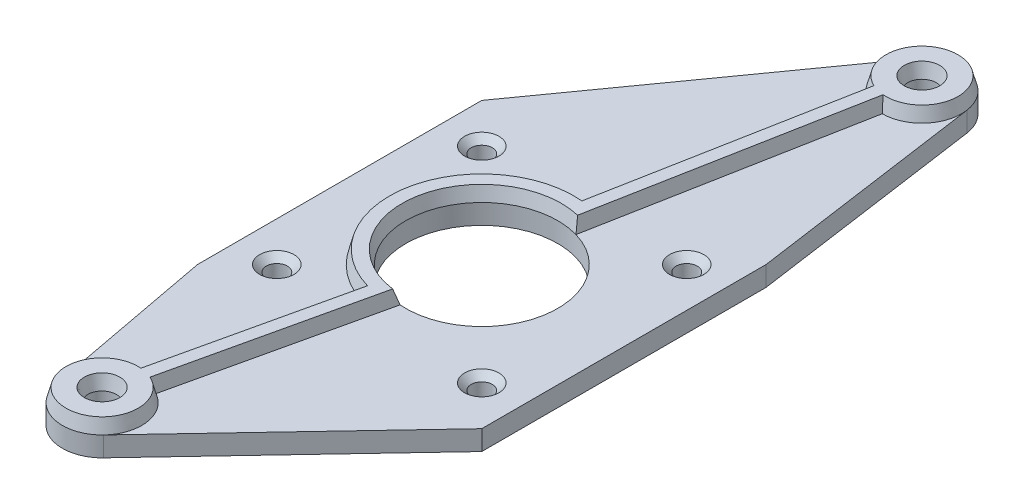
ISO-10303-21;
HEADER;
FILE_DESCRIPTION(('STEP AP214'),'2;1');
FILE_NAME('part.step','',(''),(''),'','','');
FILE_SCHEMA(('AUTOMOTIVE_DESIGN { 1 0 10303 214 1 1 1 1 }'));
ENDSEC;
DATA;
#1=APPLICATION_CONTEXT('core data for automotive mechanical design processes');
#2=APPLICATION_PROTOCOL_DEFINITION('international standard','automotive_design',2000,#1);
#3=PRODUCT_CONTEXT('',#1,'mechanical');
#4=PRODUCT('Part','Part','',(#3));
#5=PRODUCT_RELATED_PRODUCT_CATEGORY('part','',(#4));
#6=PRODUCT_DEFINITION_FORMATION('','',#4);
#7=PRODUCT_DEFINITION_CONTEXT('part definition',#1,'design');
#8=PRODUCT_DEFINITION('design','',#6,#7);
#9=PRODUCT_DEFINITION_SHAPE('','',#8);
#10=(LENGTH_UNIT() NAMED_UNIT(*) SI_UNIT(.MILLI.,.METRE.));
#11=(NAMED_UNIT(*) PLANE_ANGLE_UNIT() SI_UNIT($,.RADIAN.));
#12=(NAMED_UNIT(*) SI_UNIT($,.STERADIAN.) SOLID_ANGLE_UNIT());
#13=UNCERTAINTY_MEASURE_WITH_UNIT(LENGTH_MEASURE(1.E-05),#10,'distance_accuracy_value','');
#14=(GEOMETRIC_REPRESENTATION_CONTEXT(3) GLOBAL_UNCERTAINTY_ASSIGNED_CONTEXT((#13)) GLOBAL_UNIT_ASSIGNED_CONTEXT((#10,
#11,#12)) REPRESENTATION_CONTEXT('',''));
#15=CARTESIAN_POINT('',(0.,0.,0.));
#16=DIRECTION('',(0.,0.,1.));
#17=DIRECTION('',(1.,0.,0.));
#18=AXIS2_PLACEMENT_3D('',#15,#16,#17);
#19=CARTESIAN_POINT('',(-40.2731092172723,3.,45.3108891324553));
#20=DIRECTION('',(0.,-1.,0.));
#21=DIRECTION('',(0.,0.,-1.));
#22=AXIS2_PLACEMENT_3D('',#19,#20,#21);
#23=PLANE('',#22);
#24=CARTESIAN_POINT('',(-19.1038264481304,3.,-57.5329802377707));
#25=DIRECTION('',(0.,1.,0.));
#26=DIRECTION('',(0.,0.,1.));
#27=AXIS2_PLACEMENT_3D('',#24,#25,#26);
#28=CIRCLE('',#27,6.00000000000001);
#29=CARTESIAN_POINT('',(-19.1038264481304,3.,-51.5329802377707));
#30=VERTEX_POINT('',#29);
#31=CARTESIAN_POINT('',(-13.1631885143671,3.,-58.3748952809499));
#32=VERTEX_POINT('',#31);
#33=EDGE_CURVE('E58',#30,#32,#28,.T.);
#34=ORIENTED_EDGE('',*,*,#33,.F.);
#35=DIRECTION('',(0.18482684046529,0.,-0.98277110205969));
#36=VECTOR('',#35,1.);
#37=CARTESIAN_POINT('',(-27.8117995920776,3.,-5.23048249534848));
#38=LINE('',#37,#36);
#39=CARTESIAN_POINT('',(-26.4382641508518,3.,-12.533918164612));
#40=VERTEX_POINT('',#39);
#41=EDGE_CURVE('E348',#40,#30,#38,.T.);
#42=ORIENTED_EDGE('',*,*,#41,.F.);
#43=CARTESIAN_POINT('',(-29.643722033029,3.,-1.48968710194453));
#44=DIRECTION('',(0.,1.,0.));
#45=DIRECTION('',(0.,0.,1.));
#46=AXIS2_PLACEMENT_3D('',#43,#44,#45);
#47=CIRCLE('',#46,11.5);
#48=CARTESIAN_POINT('',(-30.5340940268448,3.,9.97579316329637));
#49=VERTEX_POINT('',#48);
#50=EDGE_CURVE('E481',#49,#40,#47,.T.);
#51=ORIENTED_EDGE('',*,*,#50,.F.);
#52=DIRECTION('',(0.221480280720096,0.,-0.975164850295655));
#53=VECTOR('',#52,1.);
#54=CARTESIAN_POINT('',(-26.8817197346499,3.,-6.10539933967484));
#55=LINE('',#54,#53);
#56=CARTESIAN_POINT('',(-37.3671948603431,3.,40.0615404347412));
#57=VERTEX_POINT('',#56);
#58=EDGE_CURVE('E65',#57,#49,#55,.T.);
#59=ORIENTED_EDGE('',*,*,#58,.F.);
#60=CARTESIAN_POINT('',(-40.2731092172723,3.,45.3108891324553));
#61=DIRECTION('',(0.,1.,0.));
#62=DIRECTION('',(0.,0.,1.));
#63=AXIS2_PLACEMENT_3D('',#60,#61,#62);
#64=CIRCLE('',#63,6.);
#65=CARTESIAN_POINT('',(-35.9096573558158,3.,49.4291761371154));
#66=VERTEX_POINT('',#65);
#67=EDGE_CURVE('E11',#66,#57,#64,.T.);
#68=ORIENTED_EDGE('',*,*,#67,.F.);
#69=DIRECTION('',(0.68638116744335,0.,-0.727241976909408));
#70=VECTOR('',#69,1.);
#71=CARTESIAN_POINT('',(-8.14372203302901,3.,20.0103128980555));
#72=LINE('',#71,#70);
#73=CARTESIAN_POINT('',(-8.14372203302901,3.,20.0103128980555));
#74=VERTEX_POINT('',#73);
#75=EDGE_CURVE('E501',#66,#74,#72,.T.);
#76=ORIENTED_EDGE('',*,*,#75,.T.);
#77=DIRECTION('',(0.,0.,-1.));
#78=VECTOR('',#77,1.);
#79=CARTESIAN_POINT('',(-8.14372203302901,3.,20.0103128980555));
#80=LINE('',#79,#78);
#81=CARTESIAN_POINT('',(-8.14372203302901,3.,-22.9896871019445));
#82=VERTEX_POINT('',#81);
#83=EDGE_CURVE('E504',#74,#82,#80,.T.);
#84=ORIENTED_EDGE('',*,*,#83,.T.);
#85=DIRECTION('',(-0.140446118803796,0.,-0.990088323187861));
#86=VECTOR('',#85,1.);
#87=CARTESIAN_POINT('',(-8.14372203302901,3.,-22.9896871019445));
#88=LINE('',#87,#86);
#89=EDGE_CURVE('E507',#82,#32,#88,.T.);
#90=ORIENTED_EDGE('',*,*,#89,.T.);
#91=EDGE_LOOP('',(#34,#42,#51,#59,#68,#76,#84,#90));
#92=FACE_BOUND('',#91,.T.);
#93=CARTESIAN_POINT('',(-14.143722033029,3.,-16.9896871019445));
#94=DIRECTION('',(0.,-1.,0.));
#95=DIRECTION('',(0.,0.,-1.));
#96=AXIS2_PLACEMENT_3D('',#93,#94,#95);
#97=CIRCLE('',#96,2.6);
#98=CARTESIAN_POINT('',(-14.143722033029,3.,-19.5896871019445));
#99=VERTEX_POINT('',#98);
#100=EDGE_CURVE('E316',#99,#99,#97,.T.);
#101=ORIENTED_EDGE('',*,*,#100,.T.);
#102=EDGE_LOOP('',(#101));
#103=FACE_BOUND('',#102,.T.);
#104=CARTESIAN_POINT('',(-14.143722033029,3.,14.0103128980555));
#105=DIRECTION('',(0.,-1.,0.));
#106=DIRECTION('',(0.,0.,-1.));
#107=AXIS2_PLACEMENT_3D('',#104,#105,#106);
#108=CIRCLE('',#107,2.6);
#109=CARTESIAN_POINT('',(-14.143722033029,3.,11.4103128980555));
#110=VERTEX_POINT('',#109);
#111=EDGE_CURVE('E319',#110,#110,#108,.T.);
#112=ORIENTED_EDGE('',*,*,#111,.T.);
#113=EDGE_LOOP('',(#112));
#114=FACE_BOUND('',#113,.T.);
#115=ADVANCED_FACE('F39',(#92,#103,#114),#23,.F.);
#116=CARTESIAN_POINT('',(-23.9866709572747,3.,-61.019788161864));
#117=VERTEX_POINT('',#116);
#118=CARTESIAN_POINT('',(-22.014726824788,3.,-52.2863947769996));
#119=VERTEX_POINT('',#118);
#120=EDGE_CURVE('E49',#117,#119,#28,.T.);
#121=ORIENTED_EDGE('',*,*,#120,.F.);
#122=DIRECTION('',(-0.581134654015552,0.,0.813807418190707));
#123=VECTOR('',#122,1.);
#124=CARTESIAN_POINT('',(-51.143722033029,3.,-22.9896871019445));
#125=LINE('',#124,#123);
#126=CARTESIAN_POINT('',(-51.143722033029,3.,-22.9896871019445));
#127=VERTEX_POINT('',#126);
#128=EDGE_CURVE('E513',#117,#127,#125,.T.);
#129=ORIENTED_EDGE('',*,*,#128,.T.);
#130=DIRECTION('',(0.,0.,1.));
#131=VECTOR('',#130,1.);
#132=CARTESIAN_POINT('',(-51.143722033029,3.,20.0103128980555));
#133=LINE('',#132,#131);
#134=CARTESIAN_POINT('',(-51.143722033029,3.,20.0103128980555));
#135=VERTEX_POINT('',#134);
#136=EDGE_CURVE('E516',#127,#135,#133,.T.);
#137=ORIENTED_EDGE('',*,*,#136,.T.);
#138=DIRECTION('',(0.185086419509454,0.,0.982722248304764));
#139=VECTOR('',#138,1.);
#140=CARTESIAN_POINT('',(-51.143722033029,3.,20.0103128980555));
#141=LINE('',#140,#139);
#142=CARTESIAN_POINT('',(-46.1694427071008,3.,46.4214076495121));
#143=VERTEX_POINT('',#142);
#144=EDGE_CURVE('E493',#135,#143,#141,.T.);
#145=ORIENTED_EDGE('',*,*,#144,.T.);
#146=CARTESIAN_POINT('',(-40.2731092172723,3.,39.3108891324554));
#147=VERTEX_POINT('',#146);
#148=EDGE_CURVE('E51',#147,#143,#64,.T.);
#149=ORIENTED_EDGE('',*,*,#148,.F.);
#150=DIRECTION('',(-0.221480280720096,0.,0.975164850295655));
#151=VECTOR('',#150,1.);
#152=CARTESIAN_POINT('',(-29.8072142855369,3.,-6.76984018183513));
#153=LINE('',#152,#151);
#154=CARTESIAN_POINT('',(-34.137549548845,3.,12.2963752168648));
#155=VERTEX_POINT('',#154);
#156=EDGE_CURVE('E153',#155,#147,#153,.T.);
#157=ORIENTED_EDGE('',*,*,#156,.F.);
#158=CARTESIAN_POINT('',(-29.643722033029,3.,-1.48968710194453));
#159=DIRECTION('',(0.,1.,0.));
#160=DIRECTION('',(0.,0.,1.));
#161=AXIS2_PLACEMENT_3D('',#158,#159,#160);
#162=CIRCLE('',#161,14.5);
#163=CARTESIAN_POINT('',(-28.8450802723241,3.,-15.9676763041113));
#164=VERTEX_POINT('',#163);
#165=EDGE_CURVE('E157',#164,#155,#162,.T.);
#166=ORIENTED_EDGE('',*,*,#165,.F.);
#167=DIRECTION('',(0.18482684046529,0.,-0.98277110205969));
#168=VECTOR('',#167,1.);
#169=CARTESIAN_POINT('',(-30.7601128982567,3.,-5.78496301674435));
#170=LINE('',#169,#168);
#171=EDGE_CURVE('E176',#164,#119,#170,.T.);
#172=ORIENTED_EDGE('',*,*,#171,.T.);
#173=EDGE_LOOP('',(#121,#129,#137,#145,#149,#157,#166,#172));
#174=FACE_BOUND('',#173,.T.);
#175=CARTESIAN_POINT('',(-45.143722033029,3.,-16.9896871019445));
#176=DIRECTION('',(0.,-1.,0.));
#177=DIRECTION('',(0.,0.,-1.));
#178=AXIS2_PLACEMENT_3D('',#175,#176,#177);
#179=CIRCLE('',#178,2.6);
#180=CARTESIAN_POINT('',(-45.143722033029,3.,-19.5896871019445));
#181=VERTEX_POINT('',#180);
#182=EDGE_CURVE('E328',#181,#181,#179,.T.);
#183=ORIENTED_EDGE('',*,*,#182,.T.);
#184=EDGE_LOOP('',(#183));
#185=FACE_BOUND('',#184,.T.);
#186=CARTESIAN_POINT('',(-45.143722033029,3.,14.0103128980555));
#187=DIRECTION('',(0.,-1.,0.));
#188=DIRECTION('',(0.,0.,-1.));
#189=AXIS2_PLACEMENT_3D('',#186,#187,#188);
#190=CIRCLE('',#189,2.6);
#191=CARTESIAN_POINT('',(-45.143722033029,3.,11.4103128980555));
#192=VERTEX_POINT('',#191);
#193=EDGE_CURVE('E578',#192,#192,#190,.T.);
#194=ORIENTED_EDGE('',*,*,#193,.T.);
#195=EDGE_LOOP('',(#194));
#196=FACE_BOUND('',#195,.T.);
#197=ADVANCED_FACE('F155',(#174,#185,#196),#23,.F.);
#198=CARTESIAN_POINT('',(-40.2731092172723,0.,45.3108891324553));
#199=DIRECTION('',(0.,-1.,0.));
#200=DIRECTION('',(0.,0.,-1.));
#201=AXIS2_PLACEMENT_3D('',#198,#199,#200);
#202=PLANE('',#201);
#203=CARTESIAN_POINT('',(-45.143722033029,0.,-16.9896871019445));
#204=DIRECTION('',(0.,1.,0.));
#205=DIRECTION('',(0.,0.,1.));
#206=AXIS2_PLACEMENT_3D('',#203,#204,#205);
#207=CIRCLE('',#206,1.6);
#208=CARTESIAN_POINT('',(-45.143722033029,0.,-15.3896871019445));
#209=VERTEX_POINT('',#208);
#210=EDGE_CURVE('E465',#209,#209,#207,.T.);
#211=ORIENTED_EDGE('',*,*,#210,.T.);
#212=EDGE_LOOP('',(#211));
#213=FACE_BOUND('',#212,.T.);
#214=CARTESIAN_POINT('',(-14.143722033029,0.,14.0103128980555));
#215=DIRECTION('',(0.,1.,0.));
#216=DIRECTION('',(0.,0.,1.));
#217=AXIS2_PLACEMENT_3D('',#214,#215,#216);
#218=CIRCLE('',#217,1.6);
#219=CARTESIAN_POINT('',(-14.143722033029,0.,15.6103128980555));
#220=VERTEX_POINT('',#219);
#221=EDGE_CURVE('E473',#220,#220,#218,.T.);
#222=ORIENTED_EDGE('',*,*,#221,.T.);
#223=EDGE_LOOP('',(#222));
#224=FACE_BOUND('',#223,.T.);
#225=CARTESIAN_POINT('',(-40.2731092172723,0.,45.3108891324553));
#226=DIRECTION('',(0.,1.,0.));
#227=DIRECTION('',(0.,0.,1.));
#228=AXIS2_PLACEMENT_3D('',#225,#226,#227);
#229=CIRCLE('',#228,2.15);
#230=CARTESIAN_POINT('',(-40.2731092172723,0.,47.4608891324553));
#231=VERTEX_POINT('',#230);
#232=EDGE_CURVE('E480',#231,#231,#229,.T.);
#233=ORIENTED_EDGE('',*,*,#232,.T.);
#234=EDGE_LOOP('',(#233));
#235=FACE_BOUND('',#234,.T.);
#236=DIRECTION('',(0.185086419509454,0.,0.982722248304764));
#237=VECTOR('',#236,1.);
#238=CARTESIAN_POINT('',(-51.143722033029,0.,20.0103128980555));
#239=LINE('',#238,#237);
#240=CARTESIAN_POINT('',(-51.143722033029,0.,20.0103128980555));
#241=VERTEX_POINT('',#240);
#242=CARTESIAN_POINT('',(-46.1694427071008,0.,46.4214076495121));
#243=VERTEX_POINT('',#242);
#244=EDGE_CURVE('E492',#241,#243,#239,.T.);
#245=ORIENTED_EDGE('',*,*,#244,.F.);
#246=DIRECTION('',(0.,0.,1.));
#247=VECTOR('',#246,1.);
#248=CARTESIAN_POINT('',(-51.143722033029,0.,20.0103128980555));
#249=LINE('',#248,#247);
#250=CARTESIAN_POINT('',(-51.143722033029,0.,-22.9896871019445));
#251=VERTEX_POINT('',#250);
#252=EDGE_CURVE('E497',#251,#241,#249,.T.);
#253=ORIENTED_EDGE('',*,*,#252,.F.);
#254=DIRECTION('',(-0.581134654015552,0.,0.813807418190707));
#255=VECTOR('',#254,1.);
#256=CARTESIAN_POINT('',(-51.143722033029,0.,-22.9896871019445));
#257=LINE('',#256,#255);
#258=CARTESIAN_POINT('',(-23.9866709572747,0.,-61.019788161864));
#259=VERTEX_POINT('',#258);
#260=EDGE_CURVE('E538',#259,#251,#257,.T.);
#261=ORIENTED_EDGE('',*,*,#260,.F.);
#262=CARTESIAN_POINT('',(-19.1038264481304,0.,-57.5329802377707));
#263=DIRECTION('',(0.,1.,0.));
#264=DIRECTION('',(0.,0.,-1.));
#265=AXIS2_PLACEMENT_3D('',#262,#263,#264);
#266=CIRCLE('',#265,6.00000000000001);
#267=CARTESIAN_POINT('',(-13.1631885143671,0.,-58.3748952809499));
#268=VERTEX_POINT('',#267);
#269=EDGE_CURVE('E535',#268,#259,#266,.T.);
#270=ORIENTED_EDGE('',*,*,#269,.F.);
#271=DIRECTION('',(-0.140446118803796,0.,-0.990088323187861));
#272=VECTOR('',#271,1.);
#273=CARTESIAN_POINT('',(-8.14372203302901,0.,-22.9896871019445));
#274=LINE('',#273,#272);
#275=CARTESIAN_POINT('',(-8.14372203302901,0.,-22.9896871019445));
#276=VERTEX_POINT('',#275);
#277=EDGE_CURVE('E532',#276,#268,#274,.T.);
#278=ORIENTED_EDGE('',*,*,#277,.F.);
#279=DIRECTION('',(0.,0.,-1.));
#280=VECTOR('',#279,1.);
#281=CARTESIAN_POINT('',(-8.14372203302901,0.,20.0103128980555));
#282=LINE('',#281,#280);
#283=CARTESIAN_POINT('',(-8.14372203302901,0.,20.0103128980555));
#284=VERTEX_POINT('',#283);
#285=EDGE_CURVE('E529',#284,#276,#282,.T.);
#286=ORIENTED_EDGE('',*,*,#285,.F.);
#287=DIRECTION('',(0.68638116744335,0.,-0.727241976909408));
#288=VECTOR('',#287,1.);
#289=CARTESIAN_POINT('',(-8.14372203302901,0.,20.0103128980555));
#290=LINE('',#289,#288);
#291=CARTESIAN_POINT('',(-35.9096573558158,0.,49.4291761371154));
#292=VERTEX_POINT('',#291);
#293=EDGE_CURVE('E526',#292,#284,#290,.T.);
#294=ORIENTED_EDGE('',*,*,#293,.F.);
#295=CARTESIAN_POINT('',(-40.2731092172723,0.,45.3108891324553));
#296=DIRECTION('',(0.,1.,0.));
#297=DIRECTION('',(0.,0.,-1.));
#298=AXIS2_PLACEMENT_3D('',#295,#296,#297);
#299=CIRCLE('',#298,6.);
#300=EDGE_CURVE('E523',#243,#292,#299,.T.);
#301=ORIENTED_EDGE('',*,*,#300,.F.);
#302=EDGE_LOOP('',(#245,#253,#261,#270,#278,#286,#294,#301));
#303=FACE_BOUND('',#302,.T.);
#304=CARTESIAN_POINT('',(-19.1038264481304,0.,-57.5329802377707));
#305=DIRECTION('',(0.,1.,0.));
#306=DIRECTION('',(0.,0.,1.));
#307=AXIS2_PLACEMENT_3D('',#304,#305,#306);
#308=CIRCLE('',#307,2.15);
#309=CARTESIAN_POINT('',(-19.1038264481304,0.,-55.3829802377707));
#310=VERTEX_POINT('',#309);
#311=EDGE_CURVE('E488',#310,#310,#308,.T.);
#312=ORIENTED_EDGE('',*,*,#311,.T.);
#313=EDGE_LOOP('',(#312));
#314=FACE_BOUND('',#313,.T.);
#315=CARTESIAN_POINT('',(-29.643722033029,0.,-1.48968710194453));
#316=DIRECTION('',(0.,1.,0.));
#317=DIRECTION('',(0.,0.,1.));
#318=AXIS2_PLACEMENT_3D('',#315,#316,#317);
#319=CIRCLE('',#318,11.5);
#320=CARTESIAN_POINT('',(-29.643722033029,0.,10.0103128980555));
#321=VERTEX_POINT('',#320);
#322=EDGE_CURVE('E477',#321,#321,#319,.T.);
#323=ORIENTED_EDGE('',*,*,#322,.T.);
#324=EDGE_LOOP('',(#323));
#325=FACE_BOUND('',#324,.T.);
#326=CARTESIAN_POINT('',(-14.143722033029,0.,-16.9896871019445));
#327=DIRECTION('',(0.,1.,0.));
#328=DIRECTION('',(0.,0.,1.));
#329=AXIS2_PLACEMENT_3D('',#326,#327,#328);
#330=CIRCLE('',#329,1.6);
#331=CARTESIAN_POINT('',(-14.143722033029,0.,-15.3896871019445));
#332=VERTEX_POINT('',#331);
#333=EDGE_CURVE('E469',#332,#332,#330,.T.);
#334=ORIENTED_EDGE('',*,*,#333,.T.);
#335=EDGE_LOOP('',(#334));
#336=FACE_BOUND('',#335,.T.);
#337=CARTESIAN_POINT('',(-45.143722033029,0.,14.0103128980555));
#338=DIRECTION('',(0.,1.,0.));
#339=DIRECTION('',(0.,0.,1.));
#340=AXIS2_PLACEMENT_3D('',#337,#338,#339);
#341=CIRCLE('',#340,1.6);
#342=CARTESIAN_POINT('',(-45.143722033029,0.,15.6103128980555));
#343=VERTEX_POINT('',#342);
#344=EDGE_CURVE('E185',#343,#343,#341,.T.);
#345=ORIENTED_EDGE('',*,*,#344,.T.);
#346=EDGE_LOOP('',(#345));
#347=FACE_BOUND('',#346,.T.);
#348=ADVANCED_FACE('F257',(#213,#224,#235,#303,#314,#325,#336,#347),#202,.T.);
#349=CARTESIAN_POINT('',(-51.143722033029,3.,20.0103128980555));
#350=DIRECTION('',(0.982722248304764,0.,-0.185086419509454));
#351=DIRECTION('',(-0.185086419509454,0.,-0.982722248304764));
#352=AXIS2_PLACEMENT_3D('',#349,#350,#351);
#353=PLANE('',#352);
#354=ORIENTED_EDGE('',*,*,#244,.T.);
#355=DIRECTION('',(0.,-1.,0.));
#356=VECTOR('',#355,1.);
#357=CARTESIAN_POINT('',(-46.1694427071008,3.,46.4214076495121));
#358=LINE('',#357,#356);
#359=EDGE_CURVE('E570',#143,#243,#358,.T.);
#360=ORIENTED_EDGE('',*,*,#359,.F.);
#361=ORIENTED_EDGE('',*,*,#144,.F.);
#362=DIRECTION('',(0.,-1.,0.));
#363=VECTOR('',#362,1.);
#364=CARTESIAN_POINT('',(-51.143722033029,3.,20.0103128980555));
#365=LINE('',#364,#363);
#366=EDGE_CURVE('E519',#135,#241,#365,.T.);
#367=ORIENTED_EDGE('',*,*,#366,.T.);
#368=EDGE_LOOP('',(#354,#360,#361,#367));
#369=FACE_BOUND('',#368,.T.);
#370=ADVANCED_FACE('F260',(#369),#353,.F.);
#371=CARTESIAN_POINT('',(-40.2731092172723,3.,45.3108891324553));
#372=DIRECTION('',(0.,-1.,0.));
#373=DIRECTION('',(0.,0.,-1.));
#374=AXIS2_PLACEMENT_3D('',#371,#372,#373);
#375=CYLINDRICAL_SURFACE('',#374,6.);
#376=ORIENTED_EDGE('',*,*,#300,.T.);
#377=DIRECTION('',(0.,-1.,0.));
#378=VECTOR('',#377,1.);
#379=CARTESIAN_POINT('',(-35.9096573558158,3.,49.4291761371154));
#380=LINE('',#379,#378);
#381=EDGE_CURVE('E566',#66,#292,#380,.T.);
#382=ORIENTED_EDGE('',*,*,#381,.F.);
#383=CARTESIAN_POINT('',(-40.2731092172723,3.,45.3108891324553));
#384=DIRECTION('',(0.,1.,0.));
#385=DIRECTION('',(0.,0.,-1.));
#386=AXIS2_PLACEMENT_3D('',#383,#384,#385);
#387=CIRCLE('',#386,6.);
#388=EDGE_CURVE('E496',#143,#66,#387,.T.);
#389=ORIENTED_EDGE('',*,*,#388,.F.);
#390=ORIENTED_EDGE('',*,*,#359,.T.);
#391=EDGE_LOOP('',(#376,#382,#389,#390));
#392=FACE_BOUND('',#391,.T.);
#393=ADVANCED_FACE('F284',(#392),#375,.T.);
#394=CARTESIAN_POINT('',(-8.14372203302901,3.,20.0103128980555));
#395=DIRECTION('',(-0.727241976909408,0.,-0.68638116744335));
#396=DIRECTION('',(-0.68638116744335,0.,0.727241976909408));
#397=AXIS2_PLACEMENT_3D('',#394,#395,#396);
#398=PLANE('',#397);
#399=ORIENTED_EDGE('',*,*,#293,.T.);
#400=DIRECTION('',(0.,-1.,0.));
#401=VECTOR('',#400,1.);
#402=CARTESIAN_POINT('',(-8.14372203302901,3.,20.0103128980555));
#403=LINE('',#402,#401);
#404=EDGE_CURVE('E562',#74,#284,#403,.T.);
#405=ORIENTED_EDGE('',*,*,#404,.F.);
#406=ORIENTED_EDGE('',*,*,#75,.F.);
#407=ORIENTED_EDGE('',*,*,#381,.T.);
#408=EDGE_LOOP('',(#399,#405,#406,#407));
#409=FACE_BOUND('',#408,.T.);
#410=ADVANCED_FACE('F280',(#409),#398,.F.);
#411=CARTESIAN_POINT('',(-8.14372203302901,3.,20.0103128980555));
#412=DIRECTION('',(-1.,0.,0.));
#413=DIRECTION('',(0.,0.,1.));
#414=AXIS2_PLACEMENT_3D('',#411,#412,#413);
#415=PLANE('',#414);
#416=ORIENTED_EDGE('',*,*,#285,.T.);
#417=DIRECTION('',(0.,-1.,0.));
#418=VECTOR('',#417,1.);
#419=CARTESIAN_POINT('',(-8.14372203302901,3.,-22.9896871019445));
#420=LINE('',#419,#418);
#421=EDGE_CURVE('E558',#82,#276,#420,.T.);
#422=ORIENTED_EDGE('',*,*,#421,.F.);
#423=ORIENTED_EDGE('',*,*,#83,.F.);
#424=ORIENTED_EDGE('',*,*,#404,.T.);
#425=EDGE_LOOP('',(#416,#422,#423,#424));
#426=FACE_BOUND('',#425,.T.);
#427=ADVANCED_FACE('F276',(#426),#415,.F.);
#428=CARTESIAN_POINT('',(-8.14372203302901,3.,-22.9896871019445));
#429=DIRECTION('',(-0.990088323187861,0.,0.140446118803796));
#430=DIRECTION('',(0.140446118803796,0.,0.990088323187861));
#431=AXIS2_PLACEMENT_3D('',#428,#429,#430);
#432=PLANE('',#431);
#433=ORIENTED_EDGE('',*,*,#277,.T.);
#434=DIRECTION('',(0.,-1.,0.));
#435=VECTOR('',#434,1.);
#436=CARTESIAN_POINT('',(-13.1631885143671,3.,-58.3748952809499));
#437=LINE('',#436,#435);
#438=EDGE_CURVE('E554',#32,#268,#437,.T.);
#439=ORIENTED_EDGE('',*,*,#438,.F.);
#440=ORIENTED_EDGE('',*,*,#89,.F.);
#441=ORIENTED_EDGE('',*,*,#421,.T.);
#442=EDGE_LOOP('',(#433,#439,#440,#441));
#443=FACE_BOUND('',#442,.T.);
#444=ADVANCED_FACE('F272',(#443),#432,.F.);
#445=CARTESIAN_POINT('',(-19.1038264481304,3.,-57.5329802377707));
#446=DIRECTION('',(0.,-1.,0.));
#447=DIRECTION('',(0.,0.,-1.));
#448=AXIS2_PLACEMENT_3D('',#445,#446,#447);
#449=CYLINDRICAL_SURFACE('',#448,6.00000000000001);
#450=ORIENTED_EDGE('',*,*,#269,.T.);
#451=DIRECTION('',(0.,-1.,0.));
#452=VECTOR('',#451,1.);
#453=CARTESIAN_POINT('',(-23.9866709572747,3.,-61.019788161864));
#454=LINE('',#453,#452);
#455=EDGE_CURVE('E550',#117,#259,#454,.T.);
#456=ORIENTED_EDGE('',*,*,#455,.F.);
#457=CARTESIAN_POINT('',(-19.1038264481304,3.,-57.5329802377707));
#458=DIRECTION('',(0.,1.,0.));
#459=DIRECTION('',(0.,0.,-1.));
#460=AXIS2_PLACEMENT_3D('',#457,#458,#459);
#461=CIRCLE('',#460,6.00000000000001);
#462=EDGE_CURVE('E510',#32,#117,#461,.T.);
#463=ORIENTED_EDGE('',*,*,#462,.F.);
#464=ORIENTED_EDGE('',*,*,#438,.T.);
#465=EDGE_LOOP('',(#450,#456,#463,#464));
#466=FACE_BOUND('',#465,.T.);
#467=ADVANCED_FACE('F268',(#466),#449,.T.);
#468=CARTESIAN_POINT('',(-51.143722033029,3.,-22.9896871019445));
#469=DIRECTION('',(0.813807418190707,0.,0.581134654015552));
#470=DIRECTION('',(0.581134654015552,0.,-0.813807418190707));
#471=AXIS2_PLACEMENT_3D('',#468,#469,#470);
#472=PLANE('',#471);
#473=ORIENTED_EDGE('',*,*,#260,.T.);
#474=DIRECTION('',(0.,-1.,0.));
#475=VECTOR('',#474,1.);
#476=CARTESIAN_POINT('',(-51.143722033029,3.,-22.9896871019445));
#477=LINE('',#476,#475);
#478=EDGE_CURVE('E546',#127,#251,#477,.T.);
#479=ORIENTED_EDGE('',*,*,#478,.F.);
#480=ORIENTED_EDGE('',*,*,#128,.F.);
#481=ORIENTED_EDGE('',*,*,#455,.T.);
#482=EDGE_LOOP('',(#473,#479,#480,#481));
#483=FACE_BOUND('',#482,.T.);
#484=ADVANCED_FACE('F264',(#483),#472,.F.);
#485=CARTESIAN_POINT('',(-51.143722033029,3.,20.0103128980555));
#486=DIRECTION('',(1.,0.,0.));
#487=DIRECTION('',(0.,0.,-1.));
#488=AXIS2_PLACEMENT_3D('',#485,#486,#487);
#489=PLANE('',#488);
#490=ORIENTED_EDGE('',*,*,#252,.T.);
#491=ORIENTED_EDGE('',*,*,#366,.F.);
#492=ORIENTED_EDGE('',*,*,#136,.F.);
#493=ORIENTED_EDGE('',*,*,#478,.T.);
#494=EDGE_LOOP('',(#490,#491,#492,#493));
#495=FACE_BOUND('',#494,.T.);
#496=ADVANCED_FACE('F253',(#495),#489,.F.);
#497=CARTESIAN_POINT('',(-19.1038264481304,3.,-57.5329802377707));
#498=DIRECTION('',(0.,-1.,0.));
#499=DIRECTION('',(0.,0.,-1.));
#500=AXIS2_PLACEMENT_3D('',#497,#498,#499);
#501=CYLINDRICAL_SURFACE('',#500,2.15);
#502=CARTESIAN_POINT('',(-19.1038264481304,3.,-57.5329802377707));
#503=DIRECTION('',(0.,1.,0.));
#504=DIRECTION('',(0.,0.,1.));
#505=AXIS2_PLACEMENT_3D('',#502,#503,#504);
#506=CIRCLE('',#505,2.15);
#507=CARTESIAN_POINT('',(-19.1038264481304,3.,-55.3829802377707));
#508=VERTEX_POINT('',#507);
#509=EDGE_CURVE('E347',#508,#508,#506,.F.);
#510=ORIENTED_EDGE('',*,*,#509,.F.);
#511=EDGE_LOOP('',(#510));
#512=FACE_BOUND('',#511,.T.);
#513=ORIENTED_EDGE('',*,*,#311,.F.);
#514=EDGE_LOOP('',(#513));
#515=FACE_BOUND('',#514,.T.);
#516=ADVANCED_FACE('F249',(#512,#515),#501,.F.);
#517=CARTESIAN_POINT('',(-40.2731092172723,3.,45.3108891324553));
#518=DIRECTION('',(0.,-1.,0.));
#519=DIRECTION('',(0.,0.,-1.));
#520=AXIS2_PLACEMENT_3D('',#517,#518,#519);
#521=CYLINDRICAL_SURFACE('',#520,2.15);
#522=CARTESIAN_POINT('',(-40.2731092172723,3.,45.3108891324553));
#523=DIRECTION('',(0.,1.,0.));
#524=DIRECTION('',(0.,0.,1.));
#525=AXIS2_PLACEMENT_3D('',#522,#523,#524);
#526=CIRCLE('',#525,2.15);
#527=CARTESIAN_POINT('',(-40.2731092172723,3.,47.4608891324553));
#528=VERTEX_POINT('',#527);
#529=EDGE_CURVE('E353',#528,#528,#526,.F.);
#530=ORIENTED_EDGE('',*,*,#529,.F.);
#531=EDGE_LOOP('',(#530));
#532=FACE_BOUND('',#531,.T.);
#533=ORIENTED_EDGE('',*,*,#232,.F.);
#534=EDGE_LOOP('',(#533));
#535=FACE_BOUND('',#534,.T.);
#536=ADVANCED_FACE('F245',(#532,#535),#521,.F.);
#537=CARTESIAN_POINT('',(-29.643722033029,3.,-1.48968710194453));
#538=DIRECTION('',(0.,-1.,0.));
#539=DIRECTION('',(0.,0.,-1.));
#540=AXIS2_PLACEMENT_3D('',#537,#538,#539);
#541=CYLINDRICAL_SURFACE('',#540,11.5);
#542=EDGE_CURVE('E441',#40,#49,#47,.T.);
#543=ORIENTED_EDGE('',*,*,#542,.T.);
#544=ORIENTED_EDGE('',*,*,#50,.T.);
#545=EDGE_LOOP('',(#543,#544));
#546=FACE_BOUND('',#545,.T.);
#547=ORIENTED_EDGE('',*,*,#322,.F.);
#548=EDGE_LOOP('',(#547));
#549=FACE_BOUND('',#548,.T.);
#550=ADVANCED_FACE('F241',(#546,#549),#541,.F.);
#551=CARTESIAN_POINT('',(-14.143722033029,3.,14.0103128980555));
#552=DIRECTION('',(0.,-1.,0.));
#553=DIRECTION('',(0.,0.,-1.));
#554=AXIS2_PLACEMENT_3D('',#551,#552,#553);
#555=CYLINDRICAL_SURFACE('',#554,1.6);
#556=CARTESIAN_POINT('',(-14.143722033029,2.00000000000001,14.0103128980555));
#557=DIRECTION('',(0.,-1.,0.));
#558=DIRECTION('',(0.,0.,-1.));
#559=AXIS2_PLACEMENT_3D('',#556,#557,#558);
#560=CIRCLE('',#559,1.6);
#561=CARTESIAN_POINT('',(-14.143722033029,2.00000000000001,12.4103128980555));
#562=VERTEX_POINT('',#561);
#563=EDGE_CURVE('E574',#562,#562,#560,.F.);
#564=ORIENTED_EDGE('',*,*,#563,.T.);
#565=EDGE_LOOP('',(#564));
#566=FACE_BOUND('',#565,.T.);
#567=ORIENTED_EDGE('',*,*,#221,.F.);
#568=EDGE_LOOP('',(#567));
#569=FACE_BOUND('',#568,.T.);
#570=ADVANCED_FACE('F237',(#566,#569),#555,.F.);
#571=CARTESIAN_POINT('',(-14.143722033029,3.,-16.9896871019445));
#572=DIRECTION('',(0.,-1.,0.));
#573=DIRECTION('',(0.,0.,-1.));
#574=AXIS2_PLACEMENT_3D('',#571,#572,#573);
#575=CYLINDRICAL_SURFACE('',#574,1.6);
#576=CARTESIAN_POINT('',(-14.143722033029,2.00000000000001,-16.9896871019445));
#577=DIRECTION('',(0.,-1.,0.));
#578=DIRECTION('',(0.,0.,-1.));
#579=AXIS2_PLACEMENT_3D('',#576,#577,#578);
#580=CIRCLE('',#579,1.6);
#581=CARTESIAN_POINT('',(-14.143722033029,2.00000000000001,-18.5896871019445));
#582=VERTEX_POINT('',#581);
#583=EDGE_CURVE('E321',#582,#582,#580,.F.);
#584=ORIENTED_EDGE('',*,*,#583,.T.);
#585=EDGE_LOOP('',(#584));
#586=FACE_BOUND('',#585,.T.);
#587=ORIENTED_EDGE('',*,*,#333,.F.);
#588=EDGE_LOOP('',(#587));
#589=FACE_BOUND('',#588,.T.);
#590=ADVANCED_FACE('F233',(#586,#589),#575,.F.);
#591=CARTESIAN_POINT('',(-45.143722033029,3.,-16.9896871019445));
#592=DIRECTION('',(0.,-1.,0.));
#593=DIRECTION('',(0.,0.,-1.));
#594=AXIS2_PLACEMENT_3D('',#591,#592,#593);
#595=CYLINDRICAL_SURFACE('',#594,1.6);
#596=CARTESIAN_POINT('',(-45.143722033029,2.,-16.9896871019445));
#597=DIRECTION('',(0.,-1.,0.));
#598=DIRECTION('',(0.,0.,-1.));
#599=AXIS2_PLACEMENT_3D('',#596,#597,#598);
#600=CIRCLE('',#599,1.6);
#601=CARTESIAN_POINT('',(-45.143722033029,2.,-18.5896871019445));
#602=VERTEX_POINT('',#601);
#603=EDGE_CURVE('E326',#602,#602,#600,.F.);
#604=ORIENTED_EDGE('',*,*,#603,.T.);
#605=EDGE_LOOP('',(#604));
#606=FACE_BOUND('',#605,.T.);
#607=ORIENTED_EDGE('',*,*,#210,.F.);
#608=EDGE_LOOP('',(#607));
#609=FACE_BOUND('',#608,.T.);
#610=ADVANCED_FACE('F229',(#606,#609),#595,.F.);
#611=CARTESIAN_POINT('',(-45.143722033029,3.,14.0103128980555));
#612=DIRECTION('',(0.,-1.,0.));
#613=DIRECTION('',(0.,0.,-1.));
#614=AXIS2_PLACEMENT_3D('',#611,#612,#613);
#615=CYLINDRICAL_SURFACE('',#614,1.6);
#616=CARTESIAN_POINT('',(-45.143722033029,2.,14.0103128980555));
#617=DIRECTION('',(0.,-1.,0.));
#618=DIRECTION('',(0.,0.,-1.));
#619=AXIS2_PLACEMENT_3D('',#616,#617,#618);
#620=CIRCLE('',#619,1.6);
#621=CARTESIAN_POINT('',(-45.143722033029,2.,12.4103128980555));
#622=VERTEX_POINT('',#621);
#623=EDGE_CURVE('E43',#622,#622,#620,.F.);
#624=ORIENTED_EDGE('',*,*,#623,.T.);
#625=EDGE_LOOP('',(#624));
#626=FACE_BOUND('',#625,.T.);
#627=ORIENTED_EDGE('',*,*,#344,.F.);
#628=EDGE_LOOP('',(#627));
#629=FACE_BOUND('',#628,.T.);
#630=ADVANCED_FACE('F225',(#626,#629),#615,.F.);
#631=CARTESIAN_POINT('',(-14.143722033029,2.00000000000001,14.0103128980555));
#632=DIRECTION('',(0.,1.,0.));
#633=DIRECTION('',(0.,0.,1.));
#634=AXIS2_PLACEMENT_3D('',#631,#632,#633);
#635=CONICAL_SURFACE('',#634,1.6,0.785398163397452);
#636=ORIENTED_EDGE('',*,*,#111,.F.);
#637=EDGE_LOOP('',(#636));
#638=FACE_BOUND('',#637,.T.);
#639=ORIENTED_EDGE('',*,*,#563,.F.);
#640=EDGE_LOOP('',(#639));
#641=FACE_BOUND('',#640,.T.);
#642=ADVANCED_FACE('F228',(#638,#641),#635,.F.);
#643=CARTESIAN_POINT('',(-14.143722033029,2.00000000000001,-16.9896871019445));
#644=DIRECTION('',(0.,1.,0.));
#645=DIRECTION('',(0.,0.,1.));
#646=AXIS2_PLACEMENT_3D('',#643,#644,#645);
#647=CONICAL_SURFACE('',#646,1.6,0.785398163397452);
#648=ORIENTED_EDGE('',*,*,#100,.F.);
#649=EDGE_LOOP('',(#648));
#650=FACE_BOUND('',#649,.T.);
#651=ORIENTED_EDGE('',*,*,#583,.F.);
#652=EDGE_LOOP('',(#651));
#653=FACE_BOUND('',#652,.T.);
#654=ADVANCED_FACE('F294',(#650,#653),#647,.F.);
#655=CARTESIAN_POINT('',(-45.143722033029,2.,-16.9896871019445));
#656=DIRECTION('',(0.,1.,0.));
#657=DIRECTION('',(0.,0.,1.));
#658=AXIS2_PLACEMENT_3D('',#655,#656,#657);
#659=CONICAL_SURFACE('',#658,1.6,0.785398163397452);
#660=ORIENTED_EDGE('',*,*,#182,.F.);
#661=EDGE_LOOP('',(#660));
#662=FACE_BOUND('',#661,.T.);
#663=ORIENTED_EDGE('',*,*,#603,.F.);
#664=EDGE_LOOP('',(#663));
#665=FACE_BOUND('',#664,.T.);
#666=ADVANCED_FACE('F297',(#662,#665),#659,.F.);
#667=CARTESIAN_POINT('',(-45.143722033029,2.,14.0103128980555));
#668=DIRECTION('',(0.,1.,0.));
#669=DIRECTION('',(0.,0.,1.));
#670=AXIS2_PLACEMENT_3D('',#667,#668,#669);
#671=CONICAL_SURFACE('',#670,1.6,0.785398163397452);
#672=ORIENTED_EDGE('',*,*,#193,.F.);
#673=EDGE_LOOP('',(#672));
#674=FACE_BOUND('',#673,.T.);
#675=ORIENTED_EDGE('',*,*,#623,.F.);
#676=EDGE_LOOP('',(#675));
#677=FACE_BOUND('',#676,.T.);
#678=ADVANCED_FACE('F41',(#674,#677),#671,.F.);
#679=CARTESIAN_POINT('',(-30.7601128982567,3.,-5.78496301674435));
#680=DIRECTION('',(-0.949283988810025,0.258819045102521,-0.178529018596833));
#681=DIRECTION('',(-0.263044955168612,-0.964783577575999,0.));
#682=AXIS2_PLACEMENT_3D('',#679,#680,#681);
#683=PLANE('',#682);
#684=ORIENTED_EDGE('',*,*,#171,.F.);
#685=CARTESIAN_POINT('',(-28.4067561971403,5.,-15.3988944639309));
#686=CARTESIAN_POINT('',(-28.4794988592924,4.66695170498595,-15.4949337372042));
#687=CARTESIAN_POINT('',(-28.5523971990036,4.33376088003534,-15.5903518635446));
#688=CARTESIAN_POINT('',(-28.6985052241051,3.66709421333184,-15.7799458101108));
#689=CARTESIAN_POINT('',(-28.7717149094551,3.33361837161578,-15.8741216304972));
#690=CARTESIAN_POINT('',(-28.8450802723241,3.,-15.9676763041113));
#691=B_SPLINE_CURVE_WITH_KNOTS('',3,(#685,#686,#687,#688,#689,#690),.UNSPECIFIED.,.F.,.F.,(4,2,
4),(0.,1.06250374746829,2.12500735764783),.UNSPECIFIED.);
#692=CARTESIAN_POINT('',(-28.4067561971403,5.,-15.3988944639309));
#693=VERTEX_POINT('',#692);
#694=EDGE_CURVE('E173',#693,#164,#691,.T.);
#695=ORIENTED_EDGE('',*,*,#694,.F.);
#696=DIRECTION('',(0.18482684046529,0.,-0.98277110205969));
#697=VECTOR('',#696,1.);
#698=CARTESIAN_POINT('',(-30.2334474519736,5.,-5.6859146114598));
#699=LINE('',#698,#697);
#700=CARTESIAN_POINT('',(-21.4139803889184,5.,-52.5812537479075));
#701=VERTEX_POINT('',#700);
#702=EDGE_CURVE('E202',#693,#701,#699,.T.);
#703=ORIENTED_EDGE('',*,*,#702,.T.);
#704=CARTESIAN_POINT('',(-21.4139803889184,5.,-52.5812537479075));
#705=CARTESIAN_POINT('',(-21.4642070506227,4.83356252951338,-52.5554754255774));
#706=CARTESIAN_POINT('',(-21.5143901643654,4.66706203957337,-52.5300200200366));
#707=CARTESIAN_POINT('',(-21.6146725378132,4.33394527604685,-52.4797229372384));
#708=CARTESIAN_POINT('',(-21.6647717984826,4.1673290038235,-52.4548812528772));
#709=CARTESIAN_POINT('',(-21.7648908013236,3.83398730703861,-52.4057789456622));
#710=CARTESIAN_POINT('',(-21.8149105436055,3.66726188262885,-52.3815183220022));
#711=CARTESIAN_POINT('',(-21.9148745704151,3.33370683271675,-52.3335493662143));
#712=CARTESIAN_POINT('',(-21.9648188540623,3.16687720603017,-52.3098410404847));
#713=CARTESIAN_POINT('',(-22.014726824788,3.00000000000001,-52.2863947769995));
#714=B_SPLINE_CURVE_WITH_KNOTS('',3,(#704,#705,#706,#707,#708,#709,#710,#711,#712,#713),
.UNSPECIFIED.,.F.,.F.,(4,2,2,2,4),(0.,0.527254693904208,1.0545032819403,1.58175113831476,
2.10900509982534),.UNSPECIFIED.);
#715=EDGE_CURVE('E365',#701,#119,#714,.T.);
#716=ORIENTED_EDGE('',*,*,#715,.T.);
#717=EDGE_LOOP('',(#684,#695,#703,#716));
#718=FACE_BOUND('',#717,.T.);
#719=ADVANCED_FACE('F304',(#718),#683,.T.);
#720=CARTESIAN_POINT('',(-29.643722033029,3.,-1.48968710194453));
#721=DIRECTION('',(0.,-1.,0.));
#722=DIRECTION('',(0.,0.,1.));
#723=AXIS2_PLACEMENT_3D('',#720,#721,#722);
#724=CONICAL_SURFACE('',#723,14.5,0.26179938779915);
#725=ORIENTED_EDGE('',*,*,#165,.T.);
#726=CARTESIAN_POINT('',(-33.5047938130908,5.,11.9300095647877));
#727=CARTESIAN_POINT('',(-33.6104740512351,4.66698537843754,11.9924289126812));
#728=CARTESIAN_POINT('',(-33.716043818878,4.33381138854725,12.0541690598608));
#729=CARTESIAN_POINT('',(-33.9269623974298,3.66714472183304,12.1762909436839));
#730=CARTESIAN_POINT('',(-34.0323112083717,3.33365204505667,12.23667268053));
#731=CARTESIAN_POINT('',(-34.137549548845,3.,12.2963752168648));
#732=B_SPLINE_CURVE_WITH_KNOTS('',3,(#726,#727,#728,#729,#730,#731),.UNSPECIFIED.,.F.,.F.,(4,2,
4),(0.,1.06473262483127,2.12946509084048),.UNSPECIFIED.);
#733=CARTESIAN_POINT('',(-33.5047938130908,5.,11.9300095647877));
#734=VERTEX_POINT('',#733);
#735=EDGE_CURVE('E171',#734,#155,#732,.T.);
#736=ORIENTED_EDGE('',*,*,#735,.F.);
#737=CARTESIAN_POINT('',(-29.643722033029,5.,-1.48968710194453));
#738=DIRECTION('',(0.,1.,0.));
#739=DIRECTION('',(0.,0.,1.));
#740=AXIS2_PLACEMENT_3D('',#737,#738,#739);
#741=CIRCLE('',#740,13.9641016151378);
#742=EDGE_CURVE('E632',#693,#734,#741,.T.);
#743=ORIENTED_EDGE('',*,*,#742,.F.);
#744=ORIENTED_EDGE('',*,*,#694,.T.);
#745=EDGE_LOOP('',(#725,#736,#743,#744));
#746=FACE_BOUND('',#745,.T.);
#747=ADVANCED_FACE('F169',(#746),#724,.T.);
#748=CARTESIAN_POINT('',(-29.8072142855369,3.,-6.76984018183513));
#749=DIRECTION('',(-0.941936913789886,0.258819045102521,-0.213933523161294));
#750=DIRECTION('',(-0.264953182521529,-0.964261277388921,0.));
#751=AXIS2_PLACEMENT_3D('',#748,#749,#750);
#752=PLANE('',#751);
#753=ORIENTED_EDGE('',*,*,#156,.T.);
#754=CARTESIAN_POINT('',(-39.8490199707243,5.,39.863269948673));
#755=CARTESIAN_POINT('',(-39.8839594303526,4.83363738238833,39.8158391070301));
#756=CARTESIAN_POINT('',(-39.9190073891252,4.66719059645845,39.7687841531118));
#757=CARTESIAN_POINT('',(-39.9893073839299,4.33414331413818,39.6753868250865));
#758=CARTESIAN_POINT('',(-40.0245594165963,4.16754282032082,39.6290444392727));
#759=CARTESIAN_POINT('',(-40.0952557174432,3.83419760925188,39.5370315864419));
#760=CARTESIAN_POINT('',(-40.1306999852387,3.66745289228982,39.4913611180794));
#761=CARTESIAN_POINT('',(-40.20177074315,3.33382619848248,39.4006564372166));
#762=CARTESIAN_POINT('',(-40.2373972362529,3.16694421942513,39.3556222351916));
#763=CARTESIAN_POINT('',(-40.2731092172723,3.00000000000001,39.3108891324553));
#764=B_SPLINE_CURVE_WITH_KNOTS('',3,(#754,#755,#756,#757,#758,#759,#760,#761,#762,#763),
.UNSPECIFIED.,.F.,.F.,(4,2,2,2,4),(0.,0.529454392871735,1.05890007803597,1.58834470279997,
2.11779803402395),.UNSPECIFIED.);
#765=CARTESIAN_POINT('',(-39.8490199707243,5.,39.863269948673));
#766=VERTEX_POINT('',#765);
#767=EDGE_CURVE('E181',#766,#147,#764,.T.);
#768=ORIENTED_EDGE('',*,*,#767,.F.);
#769=DIRECTION('',(0.221480280720096,0.,-0.975164850295655));
#770=VECTOR('',#769,1.);
#771=CARTESIAN_POINT('',(-29.284625017289,5.,-6.65114925711839));
#772=LINE('',#771,#770);
#773=EDGE_CURVE('E179',#734,#766,#772,.F.);
#774=ORIENTED_EDGE('',*,*,#773,.F.);
#775=ORIENTED_EDGE('',*,*,#735,.T.);
#776=EDGE_LOOP('',(#753,#768,#774,#775));
#777=FACE_BOUND('',#776,.T.);
#778=ADVANCED_FACE('F178',(#777),#752,.T.);
#779=CARTESIAN_POINT('',(-40.2731092172723,3.,45.3108891324553));
#780=DIRECTION('',(0.,-1.,0.));
#781=DIRECTION('',(0.,0.,1.));
#782=AXIS2_PLACEMENT_3D('',#779,#780,#781);
#783=CONICAL_SURFACE('',#782,6.,0.26179938779915);
#784=ORIENTED_EDGE('',*,*,#148,.T.);
#785=ORIENTED_EDGE('',*,*,#388,.T.);
#786=ORIENTED_EDGE('',*,*,#67,.T.);
#787=CARTESIAN_POINT('',(-37.9822983646408,5.,40.3501843339396));
#788=CARTESIAN_POINT('',(-37.9308178576484,4.83358946633753,40.3248438712612));
#789=CARTESIAN_POINT('',(-37.8793962996687,4.66710832784035,40.2998483761503));
#790=CARTESIAN_POINT('',(-37.7766663271022,4.33401662372657,40.2505121320372));
#791=CARTESIAN_POINT('',(-37.7253579110215,4.16740605985867,40.2261713743417));
#792=CARTESIAN_POINT('',(-37.6228481822561,3.8340631327621,40.1781087831592));
#793=CARTESIAN_POINT('',(-37.5716468693999,3.66733076972891,40.154386948681));
#794=CARTESIAN_POINT('',(-37.4693457610552,3.33374990327393,40.1075307626889));
#795=CARTESIAN_POINT('',(-37.418245966924,3.16690139833891,40.0843964189825));
#796=CARTESIAN_POINT('',(-37.3671948603431,3.00000000000001,40.0615404347412));
#797=B_SPLINE_CURVE_WITH_KNOTS('',3,(#787,#788,#789,#790,#791,#792,#793,#794,#795,#796),
.UNSPECIFIED.,.F.,.F.,(4,2,2,2,4),(0.,0.52807481524786,1.05614261552343,1.58420957008467,
2.11228353871802),.UNSPECIFIED.);
#798=CARTESIAN_POINT('',(-37.9822983646408,5.,40.3501843339396));
#799=VERTEX_POINT('',#798);
#800=EDGE_CURVE('E187',#799,#57,#797,.T.);
#801=ORIENTED_EDGE('',*,*,#800,.F.);
#802=CARTESIAN_POINT('',(-40.2731092172723,5.,45.3108891324553));
#803=DIRECTION('',(0.,1.,0.));
#804=DIRECTION('',(0.,0.,1.));
#805=AXIS2_PLACEMENT_3D('',#802,#803,#804);
#806=CIRCLE('',#805,5.46410161513775);
#807=EDGE_CURVE('E453',#766,#799,#806,.T.);
#808=ORIENTED_EDGE('',*,*,#807,.F.);
#809=ORIENTED_EDGE('',*,*,#767,.T.);
#810=EDGE_LOOP('',(#784,#785,#786,#801,#808,#809));
#811=FACE_BOUND('',#810,.T.);
#812=ADVANCED_FACE('F210',(#811),#783,.T.);
#813=CARTESIAN_POINT('',(-26.8817197346499,3.,-6.10539933967484));
#814=DIRECTION('',(0.941936913789886,0.258819045102521,0.213933523161294));
#815=DIRECTION('',(-0.264953182521529,0.964261277388921,0.));
#816=AXIS2_PLACEMENT_3D('',#813,#814,#815);
#817=PLANE('',#816);
#818=ORIENTED_EDGE('',*,*,#58,.T.);
#819=CARTESIAN_POINT('',(-31.1905258021476,5.,10.4464030464487));
#820=CARTESIAN_POINT('',(-31.1359969720076,4.83300443631659,10.4083487690007));
#821=CARTESIAN_POINT('',(-31.0814262403305,4.6660856963047,10.3700170594194));
#822=CARTESIAN_POINT('',(-30.9721992100804,4.33241152329832,10.292779323607));
#823=CARTESIAN_POINT('',(-30.9175429125507,4.16565608835219,10.2538733043311));
#824=CARTESIAN_POINT('',(-30.8081416252749,3.83231401546138,10.1754665466838));
#825=CARTESIAN_POINT('',(-30.7533966354608,3.66572737764633,10.1359658078562));
#826=CARTESIAN_POINT('',(-30.6438147472809,3.33272950572019,10.0563474569094));
#827=CARTESIAN_POINT('',(-30.5889778478109,3.16631827375604,10.0162298373311));
#828=CARTESIAN_POINT('',(-30.5340940268448,3.,9.97579316329637));
#829=B_SPLINE_CURVE_WITH_KNOTS('',3,(#819,#820,#821,#822,#823,#824,#825,#826,#827,#828),
.UNSPECIFIED.,.F.,.F.,(4,2,2,2,4),(0.,0.539241333598409,1.07847614215813,1.61771136449158,
2.15695311207219),.UNSPECIFIED.);
#830=CARTESIAN_POINT('',(-31.1905258021476,5.,10.4464030464487));
#831=VERTEX_POINT('',#830);
#832=EDGE_CURVE('E411',#831,#49,#829,.T.);
#833=ORIENTED_EDGE('',*,*,#832,.F.);
#834=DIRECTION('',(-0.221480280720096,0.,0.975164850295655));
#835=VECTOR('',#834,1.);
#836=CARTESIAN_POINT('',(-27.4043090028978,5.,-6.22409026439157));
#837=LINE('',#836,#835);
#838=EDGE_CURVE('E447',#799,#831,#837,.F.);
#839=ORIENTED_EDGE('',*,*,#838,.F.);
#840=ORIENTED_EDGE('',*,*,#800,.T.);
#841=EDGE_LOOP('',(#818,#833,#839,#840));
#842=FACE_BOUND('',#841,.T.);
#843=ADVANCED_FACE('F422',(#842),#817,.T.);
#844=CARTESIAN_POINT('',(-29.643722033029,3.,-1.48968710194453));
#845=DIRECTION('',(0.,1.,0.));
#846=DIRECTION('',(0.,0.,1.));
#847=AXIS2_PLACEMENT_3D('',#844,#845,#846);
#848=CONICAL_SURFACE('',#847,11.5,0.26179938779915);
#849=ORIENTED_EDGE('',*,*,#542,.F.);
#850=CARTESIAN_POINT('',(-26.8584984835101,5.,-13.1988877454528));
#851=CARTESIAN_POINT('',(-26.8232061871512,4.83304765570639,-13.1445098379165));
#852=CARTESIAN_POINT('',(-26.7879787409852,4.66616224692321,-13.0898841439681));
#853=CARTESIAN_POINT('',(-26.7176587967753,4.33253332143494,-12.9801209080809));
#854=CARTESIAN_POINT('',(-26.6825662973815,4.16578980332361,-12.9249833712808));
#855=CARTESIAN_POINT('',(-26.6125207643754,3.83244922661543,-12.8141790497051));
#856=CARTESIAN_POINT('',(-26.5775677308507,3.66585216811061,-12.758512264597));
#857=CARTESIAN_POINT('',(-26.5078061497535,3.3328099694218,-12.6466306666873));
#858=CARTESIAN_POINT('',(-26.4729976036337,3.16636483077818,-12.590415848395));
#859=CARTESIAN_POINT('',(-26.4382641508518,3.,-12.533918164612));
#860=B_SPLINE_CURVE_WITH_KNOTS('',3,(#850,#851,#852,#853,#854,#855,#856,#857,#858,#859),
.UNSPECIFIED.,.F.,.F.,(4,2,2,2,4),(0.,0.537289655107617,1.07457392178407,1.61185852586283,
2.14914851852592),.UNSPECIFIED.);
#861=CARTESIAN_POINT('',(-26.8584984835101,5.,-13.1988877454528));
#862=VERTEX_POINT('',#861);
#863=EDGE_CURVE('E374',#862,#40,#860,.T.);
#864=ORIENTED_EDGE('',*,*,#863,.F.);
#865=CARTESIAN_POINT('',(-29.643722033029,5.,-1.48968710194453));
#866=DIRECTION('',(0.,1.,0.));
#867=DIRECTION('',(0.,0.,1.));
#868=AXIS2_PLACEMENT_3D('',#865,#866,#867);
#869=CIRCLE('',#868,12.0358983848622);
#870=EDGE_CURVE('E442',#831,#862,#869,.F.);
#871=ORIENTED_EDGE('',*,*,#870,.F.);
#872=ORIENTED_EDGE('',*,*,#832,.T.);
#873=EDGE_LOOP('',(#849,#864,#871,#872));
#874=FACE_BOUND('',#873,.T.);
#875=ADVANCED_FACE('F402',(#874),#848,.F.);
#876=CARTESIAN_POINT('',(-27.8117995920776,3.,-5.23048249534848));
#877=DIRECTION('',(0.949283988810024,0.258819045102521,0.178529018596833));
#878=DIRECTION('',(-0.263044955168612,0.964783577575999,0.));
#879=AXIS2_PLACEMENT_3D('',#876,#877,#878);
#880=PLANE('',#879);
#881=ORIENTED_EDGE('',*,*,#41,.T.);
#882=CARTESIAN_POINT('',(-19.5449801210957,5.,-52.0867163901977));
#883=CARTESIAN_POINT('',(-19.5085947491895,4.8336726738851,-52.0390567502752));
#884=CARTESIAN_POINT('',(-19.4721069892592,4.66725113564569,-51.991804951164));
#885=CARTESIAN_POINT('',(-19.3989394933076,4.33423645271861,-51.8980733552383));
#886=CARTESIAN_POINT('',(-19.3622597609231,4.16764331132958,-51.8515935438679));
#887=CARTESIAN_POINT('',(-19.2887198305515,3.83429634527453,-51.7593605549029));
#888=CARTESIAN_POINT('',(-19.2518596329822,3.66754252098133,-51.7136073756266));
#889=CARTESIAN_POINT('',(-19.1779683984728,3.33388214775219,-51.6227880036167));
#890=CARTESIAN_POINT('',(-19.1409373583213,3.1669755959931,-51.5777218238657));
#891=CARTESIAN_POINT('',(-19.1038264481304,3.00000000000001,-51.5329802377707));
#892=B_SPLINE_CURVE_WITH_KNOTS('',3,(#882,#883,#884,#885,#886,#887,#888,#889,#890,#891),
.UNSPECIFIED.,.F.,.F.,(4,2,2,2,4),(0.,0.530415047637335,1.06082008283109,1.59122389029889,
2.12163770866614),.UNSPECIFIED.);
#893=CARTESIAN_POINT('',(-19.5449801210957,5.,-52.0867163901977));
#894=VERTEX_POINT('',#893);
#895=EDGE_CURVE('E369',#894,#30,#892,.T.);
#896=ORIENTED_EDGE('',*,*,#895,.F.);
#897=DIRECTION('',(-0.18482684046529,0.,0.98277110205969));
#898=VECTOR('',#897,1.);
#899=CARTESIAN_POINT('',(-28.3384650383607,5.,-5.32953090063302));
#900=LINE('',#899,#898);
#901=EDGE_CURVE('E446',#862,#894,#900,.F.);
#902=ORIENTED_EDGE('',*,*,#901,.F.);
#903=ORIENTED_EDGE('',*,*,#863,.T.);
#904=EDGE_LOOP('',(#881,#896,#902,#903));
#905=FACE_BOUND('',#904,.T.);
#906=ADVANCED_FACE('F218',(#905),#880,.T.);
#907=CARTESIAN_POINT('',(-19.1038264481304,3.,-57.5329802377707));
#908=DIRECTION('',(0.,1.,0.));
#909=DIRECTION('',(0.,0.,1.));
#910=AXIS2_PLACEMENT_3D('',#907,#908,#909);
#911=CONICAL_SURFACE('',#910,2.15,0.26179938779915);
#912=CARTESIAN_POINT('',(-19.1038264481304,5.,-57.5329802377707));
#913=DIRECTION('',(0.,1.,0.));
#914=DIRECTION('',(0.,0.,1.));
#915=AXIS2_PLACEMENT_3D('',#912,#913,#914);
#916=CIRCLE('',#915,2.68589838486224);
#917=CARTESIAN_POINT('',(-19.1038264481304,5.,-54.8470818529084));
#918=VERTEX_POINT('',#917);
#919=EDGE_CURVE('E377',#918,#918,#916,.F.);
#920=ORIENTED_EDGE('',*,*,#919,.F.);
#921=EDGE_LOOP('',(#920));
#922=FACE_BOUND('',#921,.T.);
#923=ORIENTED_EDGE('',*,*,#509,.T.);
#924=EDGE_LOOP('',(#923));
#925=FACE_BOUND('',#924,.T.);
#926=ADVANCED_FACE('F213',(#922,#925),#911,.F.);
#927=CARTESIAN_POINT('',(-19.1038264481304,3.,-57.5329802377707));
#928=DIRECTION('',(0.,-1.,0.));
#929=DIRECTION('',(0.,0.,1.));
#930=AXIS2_PLACEMENT_3D('',#927,#928,#929);
#931=CONICAL_SURFACE('',#930,6.00000000000001,0.26179938779915);
#932=ORIENTED_EDGE('',*,*,#33,.T.);
#933=ORIENTED_EDGE('',*,*,#462,.T.);
#934=ORIENTED_EDGE('',*,*,#120,.T.);
#935=ORIENTED_EDGE('',*,*,#715,.F.);
#936=CARTESIAN_POINT('',(-19.1038264481304,5.,-57.5329802377707));
#937=DIRECTION('',(0.,1.,0.));
#938=DIRECTION('',(0.,0.,1.));
#939=AXIS2_PLACEMENT_3D('',#936,#937,#938);
#940=CIRCLE('',#939,5.46410161513776);
#941=EDGE_CURVE('E451',#894,#701,#940,.T.);
#942=ORIENTED_EDGE('',*,*,#941,.F.);
#943=ORIENTED_EDGE('',*,*,#895,.T.);
#944=EDGE_LOOP('',(#932,#933,#934,#935,#942,#943));
#945=FACE_BOUND('',#944,.T.);
#946=ADVANCED_FACE('F217',(#945),#931,.T.);
#947=CARTESIAN_POINT('',(-40.2731092172723,3.,45.3108891324553));
#948=DIRECTION('',(0.,1.,0.));
#949=DIRECTION('',(0.,0.,1.));
#950=AXIS2_PLACEMENT_3D('',#947,#948,#949);
#951=CONICAL_SURFACE('',#950,2.15,0.26179938779915);
#952=CARTESIAN_POINT('',(-40.2731092172723,5.,45.3108891324553));
#953=DIRECTION('',(0.,1.,0.));
#954=DIRECTION('',(0.,0.,1.));
#955=AXIS2_PLACEMENT_3D('',#952,#953,#954);
#956=CIRCLE('',#955,2.68589838486225);
#957=CARTESIAN_POINT('',(-40.2731092172723,5.,47.9967875173176));
#958=VERTEX_POINT('',#957);
#959=EDGE_CURVE('E370',#958,#958,#956,.F.);
#960=ORIENTED_EDGE('',*,*,#959,.F.);
#961=EDGE_LOOP('',(#960));
#962=FACE_BOUND('',#961,.T.);
#963=ORIENTED_EDGE('',*,*,#529,.T.);
#964=EDGE_LOOP('',(#963));
#965=FACE_BOUND('',#964,.T.);
#966=ADVANCED_FACE('F220',(#962,#965),#951,.F.);
#967=CARTESIAN_POINT('',(0.,5.,0.));
#968=DIRECTION('',(0.,1.,0.));
#969=DIRECTION('',(0.,0.,1.));
#970=AXIS2_PLACEMENT_3D('',#967,#968,#969);
#971=PLANE('',#970);
#972=ORIENTED_EDGE('',*,*,#702,.F.);
#973=ORIENTED_EDGE('',*,*,#742,.T.);
#974=ORIENTED_EDGE('',*,*,#773,.T.);
#975=ORIENTED_EDGE('',*,*,#807,.T.);
#976=ORIENTED_EDGE('',*,*,#838,.T.);
#977=ORIENTED_EDGE('',*,*,#870,.T.);
#978=ORIENTED_EDGE('',*,*,#901,.T.);
#979=ORIENTED_EDGE('',*,*,#941,.T.);
#980=EDGE_LOOP('',(#972,#973,#974,#975,#976,#977,#978,#979));
#981=FACE_BOUND('',#980,.T.);
#982=ORIENTED_EDGE('',*,*,#919,.T.);
#983=EDGE_LOOP('',(#982));
#984=FACE_BOUND('',#983,.T.);
#985=ORIENTED_EDGE('',*,*,#959,.T.);
#986=EDGE_LOOP('',(#985));
#987=FACE_BOUND('',#986,.T.);
#988=ADVANCED_FACE('F223',(#981,#984,#987),#971,.T.);
#989=CLOSED_SHELL('',(#115,#197,#348,#370,#393,#410,#427,#444,#467,#484,#496,#516,#536,#550,
#570,#590,#610,#630,#642,#654,#666,#678,#719,#747,#778,#812,#843,#875,#906,#926,#946,#966,#988));
#990=MANIFOLD_SOLID_BREP('B2',#989);
#991=ADVANCED_BREP_SHAPE_REPRESENTATION('',(#18,#990),#14);
#992=SHAPE_DEFINITION_REPRESENTATION(#9,#991);
ENDSEC;
END-ISO-10303-21;
